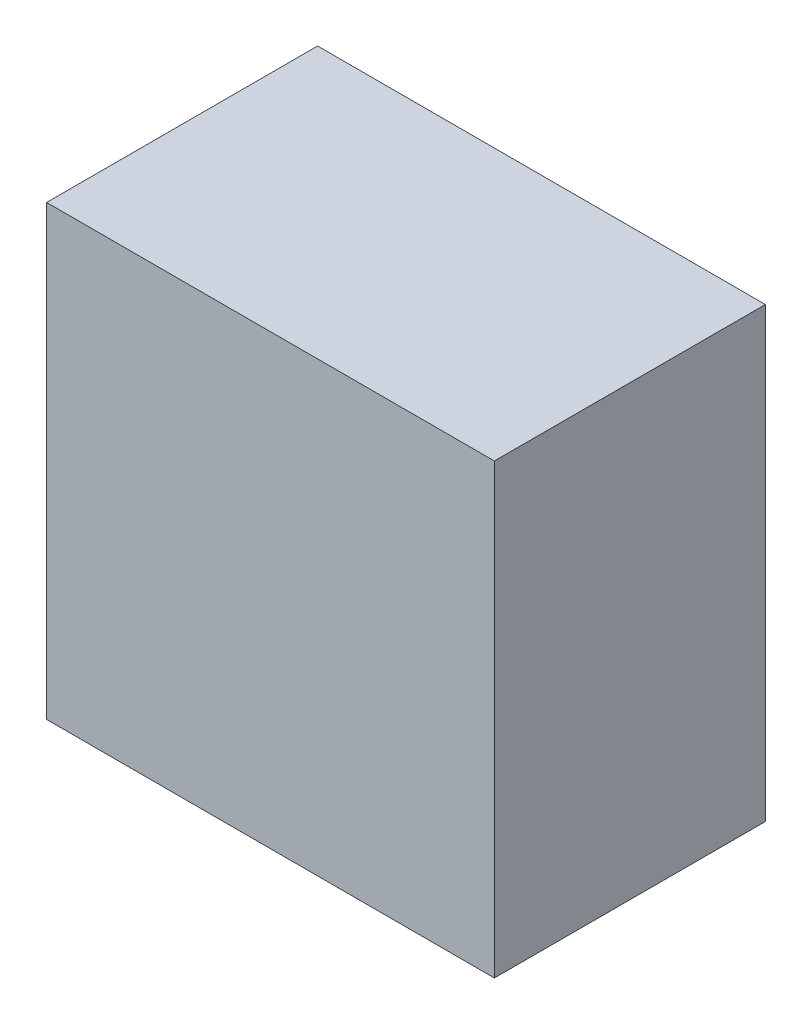
ISO-10303-21;
HEADER;
FILE_DESCRIPTION(('STEP AP214'),'2;1');
FILE_NAME('part.step','',(''),(''),'','','');
FILE_SCHEMA(('AUTOMOTIVE_DESIGN { 1 0 10303 214 1 1 1 1 }'));
ENDSEC;
DATA;
#1=APPLICATION_CONTEXT('core data for automotive mechanical design processes');
#2=APPLICATION_PROTOCOL_DEFINITION('international standard','automotive_design',2000,#1);
#3=PRODUCT_CONTEXT('',#1,'mechanical');
#4=PRODUCT('Part','Part','',(#3));
#5=PRODUCT_RELATED_PRODUCT_CATEGORY('part','',(#4));
#6=PRODUCT_DEFINITION_FORMATION('','',#4);
#7=PRODUCT_DEFINITION_CONTEXT('part definition',#1,'design');
#8=PRODUCT_DEFINITION('design','',#6,#7);
#9=PRODUCT_DEFINITION_SHAPE('','',#8);
#10=(LENGTH_UNIT() NAMED_UNIT(*) SI_UNIT(.MILLI.,.METRE.));
#11=(NAMED_UNIT(*) PLANE_ANGLE_UNIT() SI_UNIT($,.RADIAN.));
#12=(NAMED_UNIT(*) SI_UNIT($,.STERADIAN.) SOLID_ANGLE_UNIT());
#13=UNCERTAINTY_MEASURE_WITH_UNIT(LENGTH_MEASURE(1.E-05),#10,'distance_accuracy_value','');
#14=(GEOMETRIC_REPRESENTATION_CONTEXT(3) GLOBAL_UNCERTAINTY_ASSIGNED_CONTEXT((#13)) GLOBAL_UNIT_ASSIGNED_CONTEXT((#10,
#11,#12)) REPRESENTATION_CONTEXT('',''));
#15=CARTESIAN_POINT('',(0.,0.,0.));
#16=DIRECTION('',(0.,0.,1.));
#17=DIRECTION('',(1.,0.,0.));
#18=AXIS2_PLACEMENT_3D('',#15,#16,#17);
#19=CARTESIAN_POINT('',(0.,0.,0.));
#20=DIRECTION('',(0.,0.,1.));
#21=DIRECTION('',(1.,0.,0.));
#22=AXIS2_PLACEMENT_3D('',#19,#20,#21);
#23=PLANE('',#22);
#24=DIRECTION('',(0.,1.,0.));
#25=VECTOR('',#24,1.);
#26=CARTESIAN_POINT('',(190.,190.,0.));
#27=LINE('',#26,#25);
#28=CARTESIAN_POINT('',(190.,-190.,0.));
#29=VERTEX_POINT('',#28);
#30=CARTESIAN_POINT('',(190.,190.,0.));
#31=VERTEX_POINT('',#30);
#32=EDGE_CURVE('E111',#29,#31,#27,.T.);
#33=ORIENTED_EDGE('',*,*,#32,.F.);
#34=DIRECTION('',(1.,0.,0.));
#35=VECTOR('',#34,1.);
#36=CARTESIAN_POINT('',(-190.,-190.,0.));
#37=LINE('',#36,#35);
#38=CARTESIAN_POINT('',(-190.,-190.,0.));
#39=VERTEX_POINT('',#38);
#40=EDGE_CURVE('E163',#39,#29,#37,.T.);
#41=ORIENTED_EDGE('',*,*,#40,.F.);
#42=DIRECTION('',(0.,-1.,0.));
#43=VECTOR('',#42,1.);
#44=CARTESIAN_POINT('',(-190.,190.,0.));
#45=LINE('',#44,#43);
#46=CARTESIAN_POINT('',(-190.,190.,0.));
#47=VERTEX_POINT('',#46);
#48=EDGE_CURVE('E161',#47,#39,#45,.T.);
#49=ORIENTED_EDGE('',*,*,#48,.F.);
#50=DIRECTION('',(-1.,0.,0.));
#51=VECTOR('',#50,1.);
#52=CARTESIAN_POINT('',(-190.,190.,0.));
#53=LINE('',#52,#51);
#54=EDGE_CURVE('E159',#31,#47,#53,.T.);
#55=ORIENTED_EDGE('',*,*,#54,.F.);
#56=EDGE_LOOP('',(#33,#41,#49,#55));
#57=FACE_BOUND('',#56,.T.);
#58=DIRECTION('',(0.,1.,0.));
#59=VECTOR('',#58,1.);
#60=CARTESIAN_POINT('',(170.,170.,0.));
#61=LINE('',#60,#59);
#62=CARTESIAN_POINT('',(170.,-170.,0.));
#63=VERTEX_POINT('',#62);
#64=CARTESIAN_POINT('',(170.,170.,0.));
#65=VERTEX_POINT('',#64);
#66=EDGE_CURVE('E62',#63,#65,#61,.T.);
#67=ORIENTED_EDGE('',*,*,#66,.T.);
#68=DIRECTION('',(-1.,0.,0.));
#69=VECTOR('',#68,1.);
#70=CARTESIAN_POINT('',(-170.,170.,0.));
#71=LINE('',#70,#69);
#72=CARTESIAN_POINT('',(-170.,170.,0.));
#73=VERTEX_POINT('',#72);
#74=EDGE_CURVE('E143',#65,#73,#71,.T.);
#75=ORIENTED_EDGE('',*,*,#74,.T.);
#76=DIRECTION('',(0.,-1.,0.));
#77=VECTOR('',#76,1.);
#78=CARTESIAN_POINT('',(-170.,170.,0.));
#79=LINE('',#78,#77);
#80=CARTESIAN_POINT('',(-170.,-170.,0.));
#81=VERTEX_POINT('',#80);
#82=EDGE_CURVE('E146',#73,#81,#79,.T.);
#83=ORIENTED_EDGE('',*,*,#82,.T.);
#84=DIRECTION('',(1.,0.,0.));
#85=VECTOR('',#84,1.);
#86=CARTESIAN_POINT('',(-170.,-170.,0.));
#87=LINE('',#86,#85);
#88=EDGE_CURVE('E134',#81,#63,#87,.T.);
#89=ORIENTED_EDGE('',*,*,#88,.T.);
#90=EDGE_LOOP('',(#67,#75,#83,#89));
#91=FACE_BOUND('',#90,.T.);
#92=ADVANCED_FACE('F39',(#57,#91),#23,.F.);
#93=CARTESIAN_POINT('',(190.,190.,210.));
#94=DIRECTION('',(-1.,0.,0.));
#95=DIRECTION('',(0.,-1.,0.));
#96=AXIS2_PLACEMENT_3D('',#93,#94,#95);
#97=PLANE('',#96);
#98=ORIENTED_EDGE('',*,*,#32,.T.);
#99=DIRECTION('',(0.,0.,-1.));
#100=VECTOR('',#99,1.);
#101=CARTESIAN_POINT('',(190.,190.,210.));
#102=LINE('',#101,#100);
#103=CARTESIAN_POINT('',(190.,190.,230.));
#104=VERTEX_POINT('',#103);
#105=EDGE_CURVE('E11',#104,#31,#102,.T.);
#106=ORIENTED_EDGE('',*,*,#105,.F.);
#107=DIRECTION('',(0.,1.,0.));
#108=VECTOR('',#107,1.);
#109=CARTESIAN_POINT('',(190.,190.,230.));
#110=LINE('',#109,#108);
#111=CARTESIAN_POINT('',(190.,-190.,230.));
#112=VERTEX_POINT('',#111);
#113=EDGE_CURVE('E109',#112,#104,#110,.T.);
#114=ORIENTED_EDGE('',*,*,#113,.F.);
#115=DIRECTION('',(0.,0.,-1.));
#116=VECTOR('',#115,1.);
#117=CARTESIAN_POINT('',(190.,-190.,210.));
#118=LINE('',#117,#116);
#119=EDGE_CURVE('E165',#112,#29,#118,.T.);
#120=ORIENTED_EDGE('',*,*,#119,.T.);
#121=EDGE_LOOP('',(#98,#106,#114,#120));
#122=FACE_BOUND('',#121,.T.);
#123=ADVANCED_FACE('F41',(#122),#97,.F.);
#124=CARTESIAN_POINT('',(-190.,190.,210.));
#125=DIRECTION('',(0.,-1.,0.));
#126=DIRECTION('',(0.,0.,-1.));
#127=AXIS2_PLACEMENT_3D('',#124,#125,#126);
#128=PLANE('',#127);
#129=ORIENTED_EDGE('',*,*,#54,.T.);
#130=DIRECTION('',(0.,0.,-1.));
#131=VECTOR('',#130,1.);
#132=CARTESIAN_POINT('',(-190.,190.,210.));
#133=LINE('',#132,#131);
#134=CARTESIAN_POINT('',(-190.,190.,230.));
#135=VERTEX_POINT('',#134);
#136=EDGE_CURVE('E47',#135,#47,#133,.T.);
#137=ORIENTED_EDGE('',*,*,#136,.F.);
#138=DIRECTION('',(-1.,0.,0.));
#139=VECTOR('',#138,1.);
#140=CARTESIAN_POINT('',(-190.,190.,230.));
#141=LINE('',#140,#139);
#142=EDGE_CURVE('E114',#104,#135,#141,.T.);
#143=ORIENTED_EDGE('',*,*,#142,.F.);
#144=ORIENTED_EDGE('',*,*,#105,.T.);
#145=EDGE_LOOP('',(#129,#137,#143,#144));
#146=FACE_BOUND('',#145,.T.);
#147=ADVANCED_FACE('F115',(#146),#128,.F.);
#148=CARTESIAN_POINT('',(-190.,190.,210.));
#149=DIRECTION('',(1.,0.,0.));
#150=DIRECTION('',(0.,1.,0.));
#151=AXIS2_PLACEMENT_3D('',#148,#149,#150);
#152=PLANE('',#151);
#153=ORIENTED_EDGE('',*,*,#48,.T.);
#154=DIRECTION('',(0.,0.,-1.));
#155=VECTOR('',#154,1.);
#156=CARTESIAN_POINT('',(-190.,-190.,210.));
#157=LINE('',#156,#155);
#158=CARTESIAN_POINT('',(-190.,-190.,230.));
#159=VERTEX_POINT('',#158);
#160=EDGE_CURVE('E167',#159,#39,#157,.T.);
#161=ORIENTED_EDGE('',*,*,#160,.F.);
#162=DIRECTION('',(0.,-1.,0.));
#163=VECTOR('',#162,1.);
#164=CARTESIAN_POINT('',(-190.,190.,230.));
#165=LINE('',#164,#163);
#166=EDGE_CURVE('E120',#135,#159,#165,.T.);
#167=ORIENTED_EDGE('',*,*,#166,.F.);
#168=ORIENTED_EDGE('',*,*,#136,.T.);
#169=EDGE_LOOP('',(#153,#161,#167,#168));
#170=FACE_BOUND('',#169,.T.);
#171=ADVANCED_FACE('F171',(#170),#152,.F.);
#172=CARTESIAN_POINT('',(-190.,-190.,210.));
#173=DIRECTION('',(0.,1.,0.));
#174=DIRECTION('',(0.,0.,1.));
#175=AXIS2_PLACEMENT_3D('',#172,#173,#174);
#176=PLANE('',#175);
#177=ORIENTED_EDGE('',*,*,#40,.T.);
#178=ORIENTED_EDGE('',*,*,#119,.F.);
#179=DIRECTION('',(1.,0.,0.));
#180=VECTOR('',#179,1.);
#181=CARTESIAN_POINT('',(-190.,-190.,230.));
#182=LINE('',#181,#180);
#183=EDGE_CURVE('E125',#159,#112,#182,.T.);
#184=ORIENTED_EDGE('',*,*,#183,.F.);
#185=ORIENTED_EDGE('',*,*,#160,.T.);
#186=EDGE_LOOP('',(#177,#178,#184,#185));
#187=FACE_BOUND('',#186,.T.);
#188=ADVANCED_FACE('F176',(#187),#176,.F.);
#189=CARTESIAN_POINT('',(170.,170.,210.));
#190=DIRECTION('',(-1.,0.,0.));
#191=DIRECTION('',(0.,-1.,0.));
#192=AXIS2_PLACEMENT_3D('',#189,#190,#191);
#193=PLANE('',#192);
#194=ORIENTED_EDGE('',*,*,#66,.F.);
#195=DIRECTION('',(0.,0.,-1.));
#196=VECTOR('',#195,1.);
#197=CARTESIAN_POINT('',(170.,-170.,210.));
#198=LINE('',#197,#196);
#199=CARTESIAN_POINT('',(170.,-170.,210.));
#200=VERTEX_POINT('',#199);
#201=EDGE_CURVE('E141',#200,#63,#198,.T.);
#202=ORIENTED_EDGE('',*,*,#201,.F.);
#203=DIRECTION('',(0.,1.,0.));
#204=VECTOR('',#203,1.);
#205=CARTESIAN_POINT('',(170.,170.,210.));
#206=LINE('',#205,#204);
#207=CARTESIAN_POINT('',(170.,170.,210.));
#208=VERTEX_POINT('',#207);
#209=EDGE_CURVE('E130',#200,#208,#206,.T.);
#210=ORIENTED_EDGE('',*,*,#209,.T.);
#211=DIRECTION('',(0.,0.,-1.));
#212=VECTOR('',#211,1.);
#213=CARTESIAN_POINT('',(170.,170.,210.));
#214=LINE('',#213,#212);
#215=EDGE_CURVE('E156',#208,#65,#214,.T.);
#216=ORIENTED_EDGE('',*,*,#215,.T.);
#217=EDGE_LOOP('',(#194,#202,#210,#216));
#218=FACE_BOUND('',#217,.T.);
#219=ADVANCED_FACE('F178',(#218),#193,.T.);
#220=CARTESIAN_POINT('',(-170.,170.,210.));
#221=DIRECTION('',(0.,-1.,0.));
#222=DIRECTION('',(0.,0.,-1.));
#223=AXIS2_PLACEMENT_3D('',#220,#221,#222);
#224=PLANE('',#223);
#225=ORIENTED_EDGE('',*,*,#74,.F.);
#226=ORIENTED_EDGE('',*,*,#215,.F.);
#227=DIRECTION('',(-1.,0.,0.));
#228=VECTOR('',#227,1.);
#229=CARTESIAN_POINT('',(-170.,170.,210.));
#230=LINE('',#229,#228);
#231=CARTESIAN_POINT('',(-170.,170.,210.));
#232=VERTEX_POINT('',#231);
#233=EDGE_CURVE('E133',#208,#232,#230,.T.);
#234=ORIENTED_EDGE('',*,*,#233,.T.);
#235=DIRECTION('',(0.,0.,-1.));
#236=VECTOR('',#235,1.);
#237=CARTESIAN_POINT('',(-170.,170.,210.));
#238=LINE('',#237,#236);
#239=EDGE_CURVE('E154',#232,#73,#238,.T.);
#240=ORIENTED_EDGE('',*,*,#239,.T.);
#241=EDGE_LOOP('',(#225,#226,#234,#240));
#242=FACE_BOUND('',#241,.T.);
#243=ADVANCED_FACE('F184',(#242),#224,.T.);
#244=CARTESIAN_POINT('',(-170.,170.,210.));
#245=DIRECTION('',(1.,0.,0.));
#246=DIRECTION('',(0.,1.,0.));
#247=AXIS2_PLACEMENT_3D('',#244,#245,#246);
#248=PLANE('',#247);
#249=ORIENTED_EDGE('',*,*,#82,.F.);
#250=ORIENTED_EDGE('',*,*,#239,.F.);
#251=DIRECTION('',(0.,-1.,0.));
#252=VECTOR('',#251,1.);
#253=CARTESIAN_POINT('',(-170.,170.,210.));
#254=LINE('',#253,#252);
#255=CARTESIAN_POINT('',(-170.,-170.,210.));
#256=VERTEX_POINT('',#255);
#257=EDGE_CURVE('E137',#232,#256,#254,.T.);
#258=ORIENTED_EDGE('',*,*,#257,.T.);
#259=DIRECTION('',(0.,0.,-1.));
#260=VECTOR('',#259,1.);
#261=CARTESIAN_POINT('',(-170.,-170.,210.));
#262=LINE('',#261,#260);
#263=EDGE_CURVE('E152',#256,#81,#262,.T.);
#264=ORIENTED_EDGE('',*,*,#263,.T.);
#265=EDGE_LOOP('',(#249,#250,#258,#264));
#266=FACE_BOUND('',#265,.T.);
#267=ADVANCED_FACE('F195',(#266),#248,.T.);
#268=CARTESIAN_POINT('',(-170.,-170.,210.));
#269=DIRECTION('',(0.,1.,0.));
#270=DIRECTION('',(0.,0.,1.));
#271=AXIS2_PLACEMENT_3D('',#268,#269,#270);
#272=PLANE('',#271);
#273=ORIENTED_EDGE('',*,*,#88,.F.);
#274=ORIENTED_EDGE('',*,*,#263,.F.);
#275=DIRECTION('',(1.,0.,0.));
#276=VECTOR('',#275,1.);
#277=CARTESIAN_POINT('',(-170.,-170.,210.));
#278=LINE('',#277,#276);
#279=EDGE_CURVE('E54',#256,#200,#278,.T.);
#280=ORIENTED_EDGE('',*,*,#279,.T.);
#281=ORIENTED_EDGE('',*,*,#201,.T.);
#282=EDGE_LOOP('',(#273,#274,#280,#281));
#283=FACE_BOUND('',#282,.T.);
#284=ADVANCED_FACE('F199',(#283),#272,.T.);
#285=CARTESIAN_POINT('',(0.,0.,210.));
#286=DIRECTION('',(0.,0.,1.));
#287=DIRECTION('',(1.,0.,0.));
#288=AXIS2_PLACEMENT_3D('',#285,#286,#287);
#289=PLANE('',#288);
#290=ORIENTED_EDGE('',*,*,#233,.F.);
#291=ORIENTED_EDGE('',*,*,#209,.F.);
#292=ORIENTED_EDGE('',*,*,#279,.F.);
#293=ORIENTED_EDGE('',*,*,#257,.F.);
#294=EDGE_LOOP('',(#290,#291,#292,#293));
#295=FACE_BOUND('',#294,.T.);
#296=ADVANCED_FACE('F203',(#295),#289,.F.);
#297=CARTESIAN_POINT('',(0.,0.,230.));
#298=DIRECTION('',(0.,0.,1.));
#299=DIRECTION('',(1.,0.,0.));
#300=AXIS2_PLACEMENT_3D('',#297,#298,#299);
#301=PLANE('',#300);
#302=ORIENTED_EDGE('',*,*,#113,.T.);
#303=ORIENTED_EDGE('',*,*,#142,.T.);
#304=ORIENTED_EDGE('',*,*,#166,.T.);
#305=ORIENTED_EDGE('',*,*,#183,.T.);
#306=EDGE_LOOP('',(#302,#303,#304,#305));
#307=FACE_BOUND('',#306,.T.);
#308=ADVANCED_FACE('F123',(#307),#301,.T.);
#309=CLOSED_SHELL('',(#92,#123,#147,#171,#188,#219,#243,#267,#284,#296,#308));
#310=MANIFOLD_SOLID_BREP('B2',#309);
#311=ADVANCED_BREP_SHAPE_REPRESENTATION('',(#18,#310),#14);
#312=SHAPE_DEFINITION_REPRESENTATION(#9,#311);
ENDSEC;
END-ISO-10303-21;
